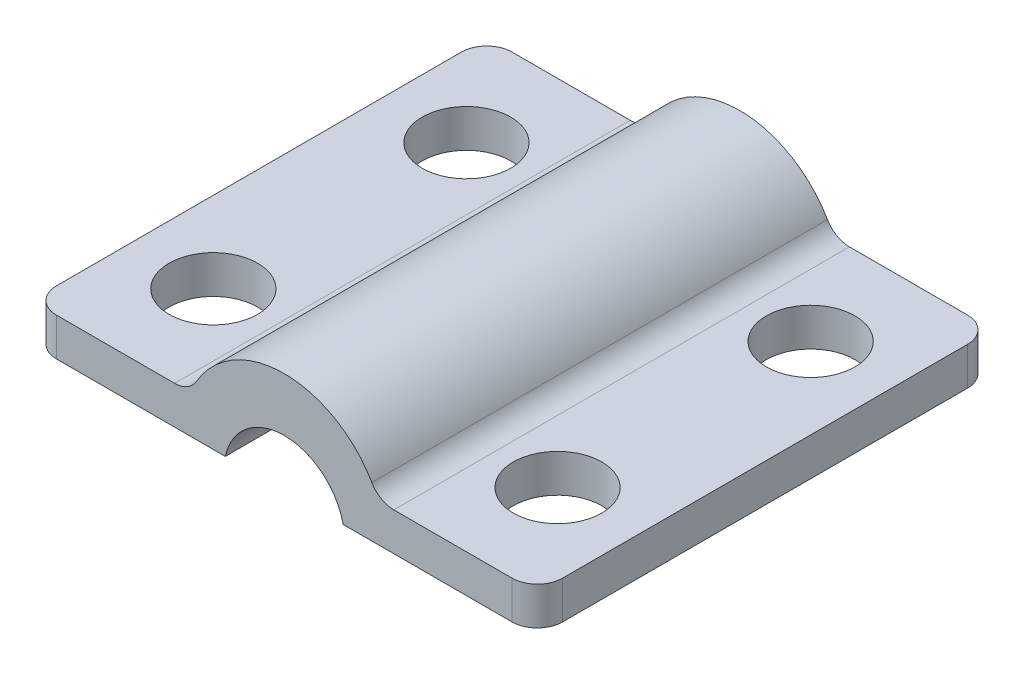
ISO-10303-21;
HEADER;
FILE_DESCRIPTION(('STEP AP214'),'2;1');
FILE_NAME('part.step','',(''),(''),'','','');
FILE_SCHEMA(('AUTOMOTIVE_DESIGN { 1 0 10303 214 1 1 1 1 }'));
ENDSEC;
DATA;
#1=APPLICATION_CONTEXT('core data for automotive mechanical design processes');
#2=APPLICATION_PROTOCOL_DEFINITION('international standard','automotive_design',2000,#1);
#3=PRODUCT_CONTEXT('',#1,'mechanical');
#4=PRODUCT('Part','Part','',(#3));
#5=PRODUCT_RELATED_PRODUCT_CATEGORY('part','',(#4));
#6=PRODUCT_DEFINITION_FORMATION('','',#4);
#7=PRODUCT_DEFINITION_CONTEXT('part definition',#1,'design');
#8=PRODUCT_DEFINITION('design','',#6,#7);
#9=PRODUCT_DEFINITION_SHAPE('','',#8);
#10=(LENGTH_UNIT() NAMED_UNIT(*) SI_UNIT(.MILLI.,.METRE.));
#11=(NAMED_UNIT(*) PLANE_ANGLE_UNIT() SI_UNIT($,.RADIAN.));
#12=(NAMED_UNIT(*) SI_UNIT($,.STERADIAN.) SOLID_ANGLE_UNIT());
#13=UNCERTAINTY_MEASURE_WITH_UNIT(LENGTH_MEASURE(1.E-05),#10,'distance_accuracy_value','');
#14=(GEOMETRIC_REPRESENTATION_CONTEXT(3) GLOBAL_UNCERTAINTY_ASSIGNED_CONTEXT((#13)) GLOBAL_UNIT_ASSIGNED_CONTEXT((#10,
#11,#12)) REPRESENTATION_CONTEXT('',''));
#15=CARTESIAN_POINT('',(0.,0.,0.));
#16=DIRECTION('',(0.,0.,1.));
#17=DIRECTION('',(1.,0.,0.));
#18=AXIS2_PLACEMENT_3D('',#15,#16,#17);
#19=CARTESIAN_POINT('',(0.,0.,-9.));
#20=DIRECTION('',(0.,-1.,0.));
#21=DIRECTION('',(0.,0.,-1.));
#22=AXIS2_PLACEMENT_3D('',#19,#20,#21);
#23=PLANE('',#22);
#24=CARTESIAN_POINT('',(6.8,0.,5.));
#25=DIRECTION('',(0.,-1.,0.));
#26=DIRECTION('',(0.,0.,-1.));
#27=AXIS2_PLACEMENT_3D('',#24,#25,#26);
#28=CIRCLE('',#27,1.75);
#29=CARTESIAN_POINT('',(6.8,0.,3.25));
#30=VERTEX_POINT('',#29);
#31=EDGE_CURVE('E371',#30,#30,#28,.F.);
#32=ORIENTED_EDGE('',*,*,#31,.T.);
#33=EDGE_LOOP('',(#32));
#34=FACE_BOUND('',#33,.T.);
#35=CARTESIAN_POINT('',(6.8,0.,-5.));
#36=DIRECTION('',(0.,-1.,0.));
#37=DIRECTION('',(0.,0.,-1.));
#38=AXIS2_PLACEMENT_3D('',#35,#36,#37);
#39=CIRCLE('',#38,1.75);
#40=CARTESIAN_POINT('',(6.8,0.,-6.75));
#41=VERTEX_POINT('',#40);
#42=EDGE_CURVE('E360',#41,#41,#39,.F.);
#43=ORIENTED_EDGE('',*,*,#42,.T.);
#44=EDGE_LOOP('',(#43));
#45=FACE_BOUND('',#44,.T.);
#46=DIRECTION('',(0.,0.,1.));
#47=VECTOR('',#46,1.);
#48=CARTESIAN_POINT('',(9.99999999999999,0.,-9.));
#49=LINE('',#48,#47);
#50=CARTESIAN_POINT('',(9.99999999999999,0.,-8.));
#51=VERTEX_POINT('',#50);
#52=CARTESIAN_POINT('',(9.99999999999999,0.,8.));
#53=VERTEX_POINT('',#52);
#54=EDGE_CURVE('E179',#51,#53,#49,.T.);
#55=ORIENTED_EDGE('',*,*,#54,.T.);
#56=CARTESIAN_POINT('',(9.,0.,8.));
#57=DIRECTION('',(0.,-1.,0.));
#58=DIRECTION('',(0.,0.,-1.));
#59=AXIS2_PLACEMENT_3D('',#56,#57,#58);
#60=CIRCLE('',#59,1.);
#61=CARTESIAN_POINT('',(9.,0.,9.));
#62=VERTEX_POINT('',#61);
#63=EDGE_CURVE('E204',#53,#62,#60,.T.);
#64=ORIENTED_EDGE('',*,*,#63,.T.);
#65=DIRECTION('',(1.,0.,0.));
#66=VECTOR('',#65,1.);
#67=CARTESIAN_POINT('',(0.,0.,9.));
#68=LINE('',#67,#66);
#69=CARTESIAN_POINT('',(2.32816484865226,0.,9.));
#70=VERTEX_POINT('',#69);
#71=EDGE_CURVE('E147',#70,#62,#68,.T.);
#72=ORIENTED_EDGE('',*,*,#71,.F.);
#73=DIRECTION('',(0.,0.,1.));
#74=VECTOR('',#73,1.);
#75=CARTESIAN_POINT('',(2.32816484865226,0.,-9.001));
#76=LINE('',#75,#74);
#77=CARTESIAN_POINT('',(2.32816484865226,0.,-9.));
#78=VERTEX_POINT('',#77);
#79=EDGE_CURVE('E155',#70,#78,#76,.F.);
#80=ORIENTED_EDGE('',*,*,#79,.T.);
#81=DIRECTION('',(1.,0.,0.));
#82=VECTOR('',#81,1.);
#83=CARTESIAN_POINT('',(0.,0.,-9.));
#84=LINE('',#83,#82);
#85=CARTESIAN_POINT('',(9.,0.,-9.));
#86=VERTEX_POINT('',#85);
#87=EDGE_CURVE('E173',#78,#86,#84,.T.);
#88=ORIENTED_EDGE('',*,*,#87,.T.);
#89=CARTESIAN_POINT('',(9.,0.,-8.));
#90=DIRECTION('',(0.,-1.,0.));
#91=DIRECTION('',(0.,0.,-1.));
#92=AXIS2_PLACEMENT_3D('',#89,#90,#91);
#93=CIRCLE('',#92,1.);
#94=EDGE_CURVE('E202',#86,#51,#93,.T.);
#95=ORIENTED_EDGE('',*,*,#94,.T.);
#96=EDGE_LOOP('',(#55,#64,#72,#80,#88,#95));
#97=FACE_BOUND('',#96,.T.);
#98=ADVANCED_FACE('F35',(#34,#45,#97),#23,.T.);
#99=CARTESIAN_POINT('',(-6.8,0.,5.));
#100=DIRECTION('',(0.,-1.,0.));
#101=DIRECTION('',(0.,0.,-1.));
#102=AXIS2_PLACEMENT_3D('',#99,#100,#101);
#103=CIRCLE('',#102,1.75);
#104=CARTESIAN_POINT('',(-6.8,0.,3.25));
#105=VERTEX_POINT('',#104);
#106=EDGE_CURVE('E376',#105,#105,#103,.F.);
#107=ORIENTED_EDGE('',*,*,#106,.T.);
#108=EDGE_LOOP('',(#107));
#109=FACE_BOUND('',#108,.T.);
#110=CARTESIAN_POINT('',(-6.8,0.,-5.));
#111=DIRECTION('',(0.,-1.,0.));
#112=DIRECTION('',(0.,0.,-1.));
#113=AXIS2_PLACEMENT_3D('',#110,#111,#112);
#114=CIRCLE('',#113,1.75);
#115=CARTESIAN_POINT('',(-6.8,0.,-6.75));
#116=VERTEX_POINT('',#115);
#117=EDGE_CURVE('E166',#116,#116,#114,.F.);
#118=ORIENTED_EDGE('',*,*,#117,.T.);
#119=EDGE_LOOP('',(#118));
#120=FACE_BOUND('',#119,.T.);
#121=DIRECTION('',(0.,0.,1.));
#122=VECTOR('',#121,1.);
#123=CARTESIAN_POINT('',(-10.,0.,-9.));
#124=LINE('',#123,#122);
#125=CARTESIAN_POINT('',(-10.,0.,-8.));
#126=VERTEX_POINT('',#125);
#127=CARTESIAN_POINT('',(-10.,0.,8.));
#128=VERTEX_POINT('',#127);
#129=EDGE_CURVE('E186',#126,#128,#124,.T.);
#130=ORIENTED_EDGE('',*,*,#129,.F.);
#131=CARTESIAN_POINT('',(-9.,0.,-8.));
#132=DIRECTION('',(0.,-1.,0.));
#133=DIRECTION('',(0.,0.,-1.));
#134=AXIS2_PLACEMENT_3D('',#131,#132,#133);
#135=CIRCLE('',#134,1.);
#136=CARTESIAN_POINT('',(-9.,0.,-9.));
#137=VERTEX_POINT('',#136);
#138=EDGE_CURVE('E227',#126,#137,#135,.T.);
#139=ORIENTED_EDGE('',*,*,#138,.T.);
#140=CARTESIAN_POINT('',(-2.32816484865226,0.,-9.));
#141=VERTEX_POINT('',#140);
#142=EDGE_CURVE('E161',#137,#141,#84,.T.);
#143=ORIENTED_EDGE('',*,*,#142,.T.);
#144=DIRECTION('',(0.,0.,1.));
#145=VECTOR('',#144,1.);
#146=CARTESIAN_POINT('',(-2.32816484865226,0.,-9.001));
#147=LINE('',#146,#145);
#148=CARTESIAN_POINT('',(-2.32816484865226,0.,9.));
#149=VERTEX_POINT('',#148);
#150=EDGE_CURVE('E152',#141,#149,#147,.T.);
#151=ORIENTED_EDGE('',*,*,#150,.T.);
#152=CARTESIAN_POINT('',(-9.,0.,9.));
#153=VERTEX_POINT('',#152);
#154=EDGE_CURVE('E136',#153,#149,#68,.T.);
#155=ORIENTED_EDGE('',*,*,#154,.F.);
#156=CARTESIAN_POINT('',(-9.,0.,8.));
#157=DIRECTION('',(0.,-1.,0.));
#158=DIRECTION('',(0.,0.,-1.));
#159=AXIS2_PLACEMENT_3D('',#156,#157,#158);
#160=CIRCLE('',#159,1.);
#161=EDGE_CURVE('E225',#153,#128,#160,.T.);
#162=ORIENTED_EDGE('',*,*,#161,.T.);
#163=EDGE_LOOP('',(#130,#139,#143,#151,#155,#162));
#164=FACE_BOUND('',#163,.T.);
#165=ADVANCED_FACE('F159',(#109,#120,#164),#23,.T.);
#166=CARTESIAN_POINT('',(-10.,0.,-9.));
#167=DIRECTION('',(-1.,0.,0.));
#168=DIRECTION('',(0.,0.,1.));
#169=AXIS2_PLACEMENT_3D('',#166,#167,#168);
#170=PLANE('',#169);
#171=DIRECTION('',(0.,0.,1.));
#172=VECTOR('',#171,1.);
#173=CARTESIAN_POINT('',(-10.,1.5,-9.));
#174=LINE('',#173,#172);
#175=CARTESIAN_POINT('',(-10.,1.5,-8.));
#176=VERTEX_POINT('',#175);
#177=CARTESIAN_POINT('',(-10.,1.5,8.));
#178=VERTEX_POINT('',#177);
#179=EDGE_CURVE('E190',#176,#178,#174,.T.);
#180=ORIENTED_EDGE('',*,*,#179,.F.);
#181=DIRECTION('',(0.,-1.,0.));
#182=VECTOR('',#181,1.);
#183=CARTESIAN_POINT('',(-10.,0.,-8.));
#184=LINE('',#183,#182);
#185=EDGE_CURVE('E222',#176,#126,#184,.T.);
#186=ORIENTED_EDGE('',*,*,#185,.T.);
#187=ORIENTED_EDGE('',*,*,#129,.T.);
#188=DIRECTION('',(0.,-1.,0.));
#189=VECTOR('',#188,1.);
#190=CARTESIAN_POINT('',(-10.,0.,8.));
#191=LINE('',#190,#189);
#192=EDGE_CURVE('E220',#128,#178,#191,.F.);
#193=ORIENTED_EDGE('',*,*,#192,.T.);
#194=EDGE_LOOP('',(#180,#186,#187,#193));
#195=FACE_BOUND('',#194,.T.);
#196=ADVANCED_FACE('F274',(#195),#170,.T.);
#197=CARTESIAN_POINT('',(0.,1.5,-9.));
#198=DIRECTION('',(0.,-1.,0.));
#199=DIRECTION('',(0.,0.,-1.));
#200=AXIS2_PLACEMENT_3D('',#197,#198,#199);
#201=PLANE('',#200);
#202=CARTESIAN_POINT('',(-6.8,1.5,5.));
#203=DIRECTION('',(0.,1.,0.));
#204=DIRECTION('',(0.,0.,-1.));
#205=AXIS2_PLACEMENT_3D('',#202,#203,#204);
#206=CIRCLE('',#205,1.75);
#207=CARTESIAN_POINT('',(-6.8,1.5,3.25));
#208=VERTEX_POINT('',#207);
#209=EDGE_CURVE('E373',#208,#208,#206,.T.);
#210=ORIENTED_EDGE('',*,*,#209,.F.);
#211=EDGE_LOOP('',(#210));
#212=FACE_BOUND('',#211,.T.);
#213=CARTESIAN_POINT('',(-6.8,1.5,-5.));
#214=DIRECTION('',(0.,1.,0.));
#215=DIRECTION('',(0.,0.,1.));
#216=AXIS2_PLACEMENT_3D('',#213,#214,#215);
#217=CIRCLE('',#216,1.75);
#218=CARTESIAN_POINT('',(-6.8,1.5,-3.25));
#219=VERTEX_POINT('',#218);
#220=EDGE_CURVE('E162',#219,#219,#217,.T.);
#221=ORIENTED_EDGE('',*,*,#220,.F.);
#222=EDGE_LOOP('',(#221));
#223=FACE_BOUND('',#222,.T.);
#224=DIRECTION('',(1.,0.,0.));
#225=VECTOR('',#224,1.);
#226=CARTESIAN_POINT('',(0.,1.5,9.));
#227=LINE('',#226,#225);
#228=CARTESIAN_POINT('',(-9.,1.5,9.));
#229=VERTEX_POINT('',#228);
#230=CARTESIAN_POINT('',(-4.33012701892219,1.5,9.));
#231=VERTEX_POINT('',#230);
#232=EDGE_CURVE('E184',#229,#231,#227,.T.);
#233=ORIENTED_EDGE('',*,*,#232,.T.);
#234=DIRECTION('',(0.,0.,1.));
#235=VECTOR('',#234,1.);
#236=CARTESIAN_POINT('',(-4.33012701892219,1.5,-9.));
#237=LINE('',#236,#235);
#238=CARTESIAN_POINT('',(-4.33012701892219,1.5,-9.));
#239=VERTEX_POINT('',#238);
#240=EDGE_CURVE('E56',#231,#239,#237,.F.);
#241=ORIENTED_EDGE('',*,*,#240,.T.);
#242=DIRECTION('',(1.,0.,0.));
#243=VECTOR('',#242,1.);
#244=CARTESIAN_POINT('',(0.,1.5,-9.));
#245=LINE('',#244,#243);
#246=CARTESIAN_POINT('',(-9.,1.5,-9.));
#247=VERTEX_POINT('',#246);
#248=EDGE_CURVE('E178',#247,#239,#245,.T.);
#249=ORIENTED_EDGE('',*,*,#248,.F.);
#250=CARTESIAN_POINT('',(-9.,1.5,-8.));
#251=DIRECTION('',(0.,-1.,0.));
#252=DIRECTION('',(0.,0.,-1.));
#253=AXIS2_PLACEMENT_3D('',#250,#251,#252);
#254=CIRCLE('',#253,1.);
#255=EDGE_CURVE('E231',#247,#176,#254,.F.);
#256=ORIENTED_EDGE('',*,*,#255,.T.);
#257=ORIENTED_EDGE('',*,*,#179,.T.);
#258=CARTESIAN_POINT('',(-9.,1.5,8.));
#259=DIRECTION('',(0.,-1.,0.));
#260=DIRECTION('',(0.,0.,-1.));
#261=AXIS2_PLACEMENT_3D('',#258,#259,#260);
#262=CIRCLE('',#261,1.);
#263=EDGE_CURVE('E229',#178,#229,#262,.F.);
#264=ORIENTED_EDGE('',*,*,#263,.T.);
#265=EDGE_LOOP('',(#233,#241,#249,#256,#257,#264));
#266=FACE_BOUND('',#265,.T.);
#267=ADVANCED_FACE('F268',(#212,#223,#266),#201,.F.);
#268=CARTESIAN_POINT('',(0.,0.,-9.));
#269=DIRECTION('',(0.,0.,1.));
#270=DIRECTION('',(1.,0.,0.));
#271=AXIS2_PLACEMENT_3D('',#268,#269,#270);
#272=CYLINDRICAL_SURFACE('',#271,4.);
#273=CARTESIAN_POINT('',(0.,0.,9.));
#274=DIRECTION('',(0.,0.,1.));
#275=DIRECTION('',(1.,0.,0.));
#276=AXIS2_PLACEMENT_3D('',#273,#274,#275);
#277=CIRCLE('',#276,4.);
#278=CARTESIAN_POINT('',(3.46410161513775,2.,9.));
#279=VERTEX_POINT('',#278);
#280=CARTESIAN_POINT('',(-3.46410161513775,2.,9.));
#281=VERTEX_POINT('',#280);
#282=EDGE_CURVE('E182',#279,#281,#277,.T.);
#283=ORIENTED_EDGE('',*,*,#282,.F.);
#284=DIRECTION('',(0.,0.,1.));
#285=VECTOR('',#284,1.);
#286=CARTESIAN_POINT('',(3.46410161513775,2.,-9.));
#287=LINE('',#286,#285);
#288=CARTESIAN_POINT('',(3.46410161513775,2.,-9.));
#289=VERTEX_POINT('',#288);
#290=EDGE_CURVE('E239',#279,#289,#287,.F.);
#291=ORIENTED_EDGE('',*,*,#290,.T.);
#292=CARTESIAN_POINT('',(0.,0.,-9.));
#293=DIRECTION('',(0.,0.,1.));
#294=DIRECTION('',(1.,0.,0.));
#295=AXIS2_PLACEMENT_3D('',#292,#293,#294);
#296=CIRCLE('',#295,4.);
#297=CARTESIAN_POINT('',(-3.46410161513775,2.,-9.));
#298=VERTEX_POINT('',#297);
#299=EDGE_CURVE('E175',#289,#298,#296,.T.);
#300=ORIENTED_EDGE('',*,*,#299,.T.);
#301=DIRECTION('',(0.,0.,1.));
#302=VECTOR('',#301,1.);
#303=CARTESIAN_POINT('',(-3.46410161513775,2.,-9.));
#304=LINE('',#303,#302);
#305=EDGE_CURVE('E236',#298,#281,#304,.T.);
#306=ORIENTED_EDGE('',*,*,#305,.T.);
#307=EDGE_LOOP('',(#283,#291,#300,#306));
#308=FACE_BOUND('',#307,.T.);
#309=ADVANCED_FACE('F262',(#308),#272,.T.);
#310=CARTESIAN_POINT('',(0.,1.5,-9.));
#311=DIRECTION('',(0.,-1.,0.));
#312=DIRECTION('',(0.,0.,-1.));
#313=AXIS2_PLACEMENT_3D('',#310,#311,#312);
#314=PLANE('',#313);
#315=CARTESIAN_POINT('',(6.8,1.5,5.));
#316=DIRECTION('',(0.,1.,0.));
#317=DIRECTION('',(0.,0.,-1.));
#318=AXIS2_PLACEMENT_3D('',#315,#316,#317);
#319=CIRCLE('',#318,1.75);
#320=CARTESIAN_POINT('',(6.8,1.5,3.25));
#321=VERTEX_POINT('',#320);
#322=EDGE_CURVE('E366',#321,#321,#319,.T.);
#323=ORIENTED_EDGE('',*,*,#322,.F.);
#324=EDGE_LOOP('',(#323));
#325=FACE_BOUND('',#324,.T.);
#326=CARTESIAN_POINT('',(6.8,1.5,-5.));
#327=DIRECTION('',(0.,1.,0.));
#328=DIRECTION('',(0.,0.,1.));
#329=AXIS2_PLACEMENT_3D('',#326,#327,#328);
#330=CIRCLE('',#329,1.75);
#331=CARTESIAN_POINT('',(6.8,1.5,-3.25));
#332=VERTEX_POINT('',#331);
#333=EDGE_CURVE('E363',#332,#332,#330,.T.);
#334=ORIENTED_EDGE('',*,*,#333,.F.);
#335=EDGE_LOOP('',(#334));
#336=FACE_BOUND('',#335,.T.);
#337=DIRECTION('',(1.,0.,0.));
#338=VECTOR('',#337,1.);
#339=CARTESIAN_POINT('',(0.,1.5,-9.));
#340=LINE('',#339,#338);
#341=CARTESIAN_POINT('',(4.33012701892219,1.5,-9.));
#342=VERTEX_POINT('',#341);
#343=CARTESIAN_POINT('',(9.,1.5,-9.));
#344=VERTEX_POINT('',#343);
#345=EDGE_CURVE('E172',#342,#344,#340,.T.);
#346=ORIENTED_EDGE('',*,*,#345,.F.);
#347=DIRECTION('',(0.,0.,1.));
#348=VECTOR('',#347,1.);
#349=CARTESIAN_POINT('',(4.33012701892219,1.5,-9.));
#350=LINE('',#349,#348);
#351=CARTESIAN_POINT('',(4.33012701892219,1.5,9.));
#352=VERTEX_POINT('',#351);
#353=EDGE_CURVE('E233',#342,#352,#350,.T.);
#354=ORIENTED_EDGE('',*,*,#353,.T.);
#355=DIRECTION('',(1.,0.,0.));
#356=VECTOR('',#355,1.);
#357=CARTESIAN_POINT('',(0.,1.5,9.));
#358=LINE('',#357,#356);
#359=CARTESIAN_POINT('',(9.,1.5,9.));
#360=VERTEX_POINT('',#359);
#361=EDGE_CURVE('E146',#352,#360,#358,.T.);
#362=ORIENTED_EDGE('',*,*,#361,.T.);
#363=CARTESIAN_POINT('',(9.,1.5,8.));
#364=DIRECTION('',(0.,-1.,0.));
#365=DIRECTION('',(0.,0.,-1.));
#366=AXIS2_PLACEMENT_3D('',#363,#364,#365);
#367=CIRCLE('',#366,1.);
#368=CARTESIAN_POINT('',(10.,1.5,8.));
#369=VERTEX_POINT('',#368);
#370=EDGE_CURVE('E213',#360,#369,#367,.F.);
#371=ORIENTED_EDGE('',*,*,#370,.T.);
#372=DIRECTION('',(0.,0.,1.));
#373=VECTOR('',#372,1.);
#374=CARTESIAN_POINT('',(10.,1.5,-9.));
#375=LINE('',#374,#373);
#376=CARTESIAN_POINT('',(10.,1.5,-8.));
#377=VERTEX_POINT('',#376);
#378=EDGE_CURVE('E193',#377,#369,#375,.T.);
#379=ORIENTED_EDGE('',*,*,#378,.F.);
#380=CARTESIAN_POINT('',(9.,1.5,-8.));
#381=DIRECTION('',(0.,-1.,0.));
#382=DIRECTION('',(0.,0.,-1.));
#383=AXIS2_PLACEMENT_3D('',#380,#381,#382);
#384=CIRCLE('',#383,1.);
#385=EDGE_CURVE('E210',#377,#344,#384,.F.);
#386=ORIENTED_EDGE('',*,*,#385,.T.);
#387=EDGE_LOOP('',(#346,#354,#362,#371,#379,#386));
#388=FACE_BOUND('',#387,.T.);
#389=ADVANCED_FACE('F254',(#325,#336,#388),#314,.F.);
#390=CARTESIAN_POINT('',(10.,0.,-9.));
#391=DIRECTION('',(-1.,0.,0.));
#392=DIRECTION('',(0.,0.,1.));
#393=AXIS2_PLACEMENT_3D('',#390,#391,#392);
#394=PLANE('',#393);
#395=ORIENTED_EDGE('',*,*,#378,.T.);
#396=DIRECTION('',(0.,-1.,0.));
#397=VECTOR('',#396,1.);
#398=CARTESIAN_POINT('',(10.,0.,8.));
#399=LINE('',#398,#397);
#400=EDGE_CURVE('E199',#369,#53,#399,.T.);
#401=ORIENTED_EDGE('',*,*,#400,.T.);
#402=ORIENTED_EDGE('',*,*,#54,.F.);
#403=DIRECTION('',(0.,-1.,0.));
#404=VECTOR('',#403,1.);
#405=CARTESIAN_POINT('',(10.,0.,-8.));
#406=LINE('',#405,#404);
#407=EDGE_CURVE('E189',#51,#377,#406,.F.);
#408=ORIENTED_EDGE('',*,*,#407,.T.);
#409=EDGE_LOOP('',(#395,#401,#402,#408));
#410=FACE_BOUND('',#409,.T.);
#411=ADVANCED_FACE('F298',(#410),#394,.F.);
#412=CARTESIAN_POINT('',(0.,0.,-9.));
#413=DIRECTION('',(0.,0.,1.));
#414=DIRECTION('',(1.,0.,0.));
#415=AXIS2_PLACEMENT_3D('',#412,#413,#414);
#416=PLANE('',#415);
#417=ORIENTED_EDGE('',*,*,#299,.F.);
#418=CARTESIAN_POINT('',(4.33012701892219,2.5,-9.));
#419=DIRECTION('',(0.,0.,1.));
#420=DIRECTION('',(1.,0.,0.));
#421=AXIS2_PLACEMENT_3D('',#418,#419,#420);
#422=CIRCLE('',#421,1.);
#423=EDGE_CURVE('E244',#289,#342,#422,.T.);
#424=ORIENTED_EDGE('',*,*,#423,.T.);
#425=ORIENTED_EDGE('',*,*,#345,.T.);
#426=DIRECTION('',(0.,-1.,0.));
#427=VECTOR('',#426,1.);
#428=CARTESIAN_POINT('',(9.,0.,-9.));
#429=LINE('',#428,#427);
#430=EDGE_CURVE('E217',#344,#86,#429,.T.);
#431=ORIENTED_EDGE('',*,*,#430,.T.);
#432=ORIENTED_EDGE('',*,*,#87,.F.);
#433=CARTESIAN_POINT('',(0.,-0.5,-9.));
#434=DIRECTION('',(0.,0.,1.));
#435=DIRECTION('',(1.,0.,0.));
#436=AXIS2_PLACEMENT_3D('',#433,#434,#435);
#437=CIRCLE('',#436,2.38125);
#438=EDGE_CURVE('E156',#141,#78,#437,.F.);
#439=ORIENTED_EDGE('',*,*,#438,.F.);
#440=ORIENTED_EDGE('',*,*,#142,.F.);
#441=DIRECTION('',(0.,-1.,0.));
#442=VECTOR('',#441,1.);
#443=CARTESIAN_POINT('',(-9.,1.5,-9.));
#444=LINE('',#443,#442);
#445=EDGE_CURVE('E215',#137,#247,#444,.F.);
#446=ORIENTED_EDGE('',*,*,#445,.T.);
#447=ORIENTED_EDGE('',*,*,#248,.T.);
#448=CARTESIAN_POINT('',(-4.33012701892219,2.5,-9.));
#449=DIRECTION('',(0.,0.,1.));
#450=DIRECTION('',(1.,0.,0.));
#451=AXIS2_PLACEMENT_3D('',#448,#449,#450);
#452=CIRCLE('',#451,1.);
#453=EDGE_CURVE('E11',#239,#298,#452,.T.);
#454=ORIENTED_EDGE('',*,*,#453,.T.);
#455=EDGE_LOOP('',(#417,#424,#425,#431,#432,#439,#440,#446,#447,#454));
#456=FACE_BOUND('',#455,.T.);
#457=ADVANCED_FACE('F249',(#456),#416,.F.);
#458=CARTESIAN_POINT('',(0.,0.,9.));
#459=DIRECTION('',(0.,0.,1.));
#460=DIRECTION('',(1.,0.,0.));
#461=AXIS2_PLACEMENT_3D('',#458,#459,#460);
#462=PLANE('',#461);
#463=ORIENTED_EDGE('',*,*,#71,.T.);
#464=DIRECTION('',(0.,-1.,0.));
#465=VECTOR('',#464,1.);
#466=CARTESIAN_POINT('',(9.,1.5,9.));
#467=LINE('',#466,#465);
#468=EDGE_CURVE('E207',#62,#360,#467,.F.);
#469=ORIENTED_EDGE('',*,*,#468,.T.);
#470=ORIENTED_EDGE('',*,*,#361,.F.);
#471=CARTESIAN_POINT('',(4.33012701892219,2.5,9.));
#472=DIRECTION('',(0.,0.,1.));
#473=DIRECTION('',(1.,0.,0.));
#474=AXIS2_PLACEMENT_3D('',#471,#472,#473);
#475=CIRCLE('',#474,1.);
#476=EDGE_CURVE('E242',#352,#279,#475,.F.);
#477=ORIENTED_EDGE('',*,*,#476,.T.);
#478=ORIENTED_EDGE('',*,*,#282,.T.);
#479=CARTESIAN_POINT('',(-4.33012701892219,2.5,9.));
#480=DIRECTION('',(0.,0.,1.));
#481=DIRECTION('',(1.,0.,0.));
#482=AXIS2_PLACEMENT_3D('',#479,#480,#481);
#483=CIRCLE('',#482,1.);
#484=EDGE_CURVE('E43',#281,#231,#483,.F.);
#485=ORIENTED_EDGE('',*,*,#484,.T.);
#486=ORIENTED_EDGE('',*,*,#232,.F.);
#487=DIRECTION('',(0.,-1.,0.));
#488=VECTOR('',#487,1.);
#489=CARTESIAN_POINT('',(-9.,0.,9.));
#490=LINE('',#489,#488);
#491=EDGE_CURVE('E143',#229,#153,#490,.T.);
#492=ORIENTED_EDGE('',*,*,#491,.T.);
#493=ORIENTED_EDGE('',*,*,#154,.T.);
#494=CARTESIAN_POINT('',(0.,-0.5,9.));
#495=DIRECTION('',(0.,0.,1.));
#496=DIRECTION('',(1.,0.,0.));
#497=AXIS2_PLACEMENT_3D('',#494,#495,#496);
#498=CIRCLE('',#497,2.38125);
#499=EDGE_CURVE('E140',#70,#149,#498,.T.);
#500=ORIENTED_EDGE('',*,*,#499,.F.);
#501=EDGE_LOOP('',(#463,#469,#470,#477,#478,#485,#486,#492,#493,#500));
#502=FACE_BOUND('',#501,.T.);
#503=ADVANCED_FACE('F139',(#502),#462,.T.);
#504=CARTESIAN_POINT('',(0.,-0.5,-9.001));
#505=DIRECTION('',(0.,0.,1.));
#506=DIRECTION('',(1.,0.,0.));
#507=AXIS2_PLACEMENT_3D('',#504,#505,#506);
#508=CYLINDRICAL_SURFACE('',#507,2.38125);
#509=ORIENTED_EDGE('',*,*,#499,.T.);
#510=ORIENTED_EDGE('',*,*,#150,.F.);
#511=ORIENTED_EDGE('',*,*,#438,.T.);
#512=ORIENTED_EDGE('',*,*,#79,.F.);
#513=EDGE_LOOP('',(#509,#510,#511,#512));
#514=FACE_BOUND('',#513,.T.);
#515=ADVANCED_FACE('F151',(#514),#508,.F.);
#516=CARTESIAN_POINT('',(6.8,-0.000999999999999916,-5.));
#517=DIRECTION('',(0.,1.,0.));
#518=DIRECTION('',(0.,0.,1.));
#519=AXIS2_PLACEMENT_3D('',#516,#517,#518);
#520=CYLINDRICAL_SURFACE('',#519,1.75);
#521=ORIENTED_EDGE('',*,*,#42,.F.);
#522=EDGE_LOOP('',(#521));
#523=FACE_BOUND('',#522,.T.);
#524=ORIENTED_EDGE('',*,*,#333,.T.);
#525=EDGE_LOOP('',(#524));
#526=FACE_BOUND('',#525,.T.);
#527=ADVANCED_FACE('F341',(#523,#526),#520,.F.);
#528=CARTESIAN_POINT('',(6.8,-0.000999999999999916,5.));
#529=DIRECTION('',(0.,1.,0.));
#530=DIRECTION('',(0.,0.,1.));
#531=AXIS2_PLACEMENT_3D('',#528,#529,#530);
#532=CYLINDRICAL_SURFACE('',#531,1.75);
#533=ORIENTED_EDGE('',*,*,#31,.F.);
#534=EDGE_LOOP('',(#533));
#535=FACE_BOUND('',#534,.T.);
#536=ORIENTED_EDGE('',*,*,#322,.T.);
#537=EDGE_LOOP('',(#536));
#538=FACE_BOUND('',#537,.T.);
#539=ADVANCED_FACE('F345',(#535,#538),#532,.F.);
#540=CARTESIAN_POINT('',(-6.8,-0.000999999999999916,-5.));
#541=DIRECTION('',(0.,1.,0.));
#542=DIRECTION('',(0.,0.,1.));
#543=AXIS2_PLACEMENT_3D('',#540,#541,#542);
#544=CYLINDRICAL_SURFACE('',#543,1.75);
#545=ORIENTED_EDGE('',*,*,#117,.F.);
#546=EDGE_LOOP('',(#545));
#547=FACE_BOUND('',#546,.T.);
#548=ORIENTED_EDGE('',*,*,#220,.T.);
#549=EDGE_LOOP('',(#548));
#550=FACE_BOUND('',#549,.T.);
#551=ADVANCED_FACE('F342',(#547,#550),#544,.F.);
#552=CARTESIAN_POINT('',(-6.8,-0.000999999999999916,5.));
#553=DIRECTION('',(0.,1.,0.));
#554=DIRECTION('',(0.,0.,1.));
#555=AXIS2_PLACEMENT_3D('',#552,#553,#554);
#556=CYLINDRICAL_SURFACE('',#555,1.75);
#557=ORIENTED_EDGE('',*,*,#106,.F.);
#558=EDGE_LOOP('',(#557));
#559=FACE_BOUND('',#558,.T.);
#560=ORIENTED_EDGE('',*,*,#209,.T.);
#561=EDGE_LOOP('',(#560));
#562=FACE_BOUND('',#561,.T.);
#563=ADVANCED_FACE('F303',(#559,#562),#556,.F.);
#564=CARTESIAN_POINT('',(9.,0.,8.));
#565=DIRECTION('',(0.,1.,0.));
#566=DIRECTION('',(0.,0.,1.));
#567=AXIS2_PLACEMENT_3D('',#564,#565,#566);
#568=CYLINDRICAL_SURFACE('',#567,1.);
#569=ORIENTED_EDGE('',*,*,#370,.F.);
#570=ORIENTED_EDGE('',*,*,#468,.F.);
#571=ORIENTED_EDGE('',*,*,#63,.F.);
#572=ORIENTED_EDGE('',*,*,#400,.F.);
#573=EDGE_LOOP('',(#569,#570,#571,#572));
#574=FACE_BOUND('',#573,.T.);
#575=ADVANCED_FACE('F300',(#574),#568,.T.);
#576=CARTESIAN_POINT('',(9.,0.,-8.));
#577=DIRECTION('',(0.,-1.,0.));
#578=DIRECTION('',(0.,0.,-1.));
#579=AXIS2_PLACEMENT_3D('',#576,#577,#578);
#580=CYLINDRICAL_SURFACE('',#579,1.);
#581=ORIENTED_EDGE('',*,*,#385,.F.);
#582=ORIENTED_EDGE('',*,*,#407,.F.);
#583=ORIENTED_EDGE('',*,*,#94,.F.);
#584=ORIENTED_EDGE('',*,*,#430,.F.);
#585=EDGE_LOOP('',(#581,#582,#583,#584));
#586=FACE_BOUND('',#585,.T.);
#587=ADVANCED_FACE('F285',(#586),#580,.T.);
#588=CARTESIAN_POINT('',(-9.,0.,-8.));
#589=DIRECTION('',(0.,1.,0.));
#590=DIRECTION('',(0.,0.,1.));
#591=AXIS2_PLACEMENT_3D('',#588,#589,#590);
#592=CYLINDRICAL_SURFACE('',#591,1.);
#593=ORIENTED_EDGE('',*,*,#255,.F.);
#594=ORIENTED_EDGE('',*,*,#445,.F.);
#595=ORIENTED_EDGE('',*,*,#138,.F.);
#596=ORIENTED_EDGE('',*,*,#185,.F.);
#597=EDGE_LOOP('',(#593,#594,#595,#596));
#598=FACE_BOUND('',#597,.T.);
#599=ADVANCED_FACE('F272',(#598),#592,.T.);
#600=CARTESIAN_POINT('',(-9.,0.,8.));
#601=DIRECTION('',(0.,-1.,0.));
#602=DIRECTION('',(0.,0.,-1.));
#603=AXIS2_PLACEMENT_3D('',#600,#601,#602);
#604=CYLINDRICAL_SURFACE('',#603,1.);
#605=ORIENTED_EDGE('',*,*,#263,.F.);
#606=ORIENTED_EDGE('',*,*,#192,.F.);
#607=ORIENTED_EDGE('',*,*,#161,.F.);
#608=ORIENTED_EDGE('',*,*,#491,.F.);
#609=EDGE_LOOP('',(#605,#606,#607,#608));
#610=FACE_BOUND('',#609,.T.);
#611=ADVANCED_FACE('F278',(#610),#604,.T.);
#612=CARTESIAN_POINT('',(4.33012701892219,2.5,-9.));
#613=DIRECTION('',(0.,0.,1.));
#614=DIRECTION('',(1.,0.,0.));
#615=AXIS2_PLACEMENT_3D('',#612,#613,#614);
#616=CYLINDRICAL_SURFACE('',#615,1.);
#617=ORIENTED_EDGE('',*,*,#423,.F.);
#618=ORIENTED_EDGE('',*,*,#290,.F.);
#619=ORIENTED_EDGE('',*,*,#476,.F.);
#620=ORIENTED_EDGE('',*,*,#353,.F.);
#621=EDGE_LOOP('',(#617,#618,#619,#620));
#622=FACE_BOUND('',#621,.T.);
#623=ADVANCED_FACE('F259',(#622),#616,.F.);
#624=CARTESIAN_POINT('',(-4.33012701892219,2.5,-9.));
#625=DIRECTION('',(0.,0.,1.));
#626=DIRECTION('',(1.,0.,0.));
#627=AXIS2_PLACEMENT_3D('',#624,#625,#626);
#628=CYLINDRICAL_SURFACE('',#627,1.);
#629=ORIENTED_EDGE('',*,*,#453,.F.);
#630=ORIENTED_EDGE('',*,*,#240,.F.);
#631=ORIENTED_EDGE('',*,*,#484,.F.);
#632=ORIENTED_EDGE('',*,*,#305,.F.);
#633=EDGE_LOOP('',(#629,#630,#631,#632));
#634=FACE_BOUND('',#633,.T.);
#635=ADVANCED_FACE('F37',(#634),#628,.F.);
#636=CLOSED_SHELL('',(#98,#165,#196,#267,#309,#389,#411,#457,#503,#515,#527,#539,#551,#563,#575,
#587,#599,#611,#623,#635));
#637=MANIFOLD_SOLID_BREP('B2',#636);
#638=ADVANCED_BREP_SHAPE_REPRESENTATION('',(#18,#637),#14);
#639=SHAPE_DEFINITION_REPRESENTATION(#9,#638);
ENDSEC;
END-ISO-10303-21;
